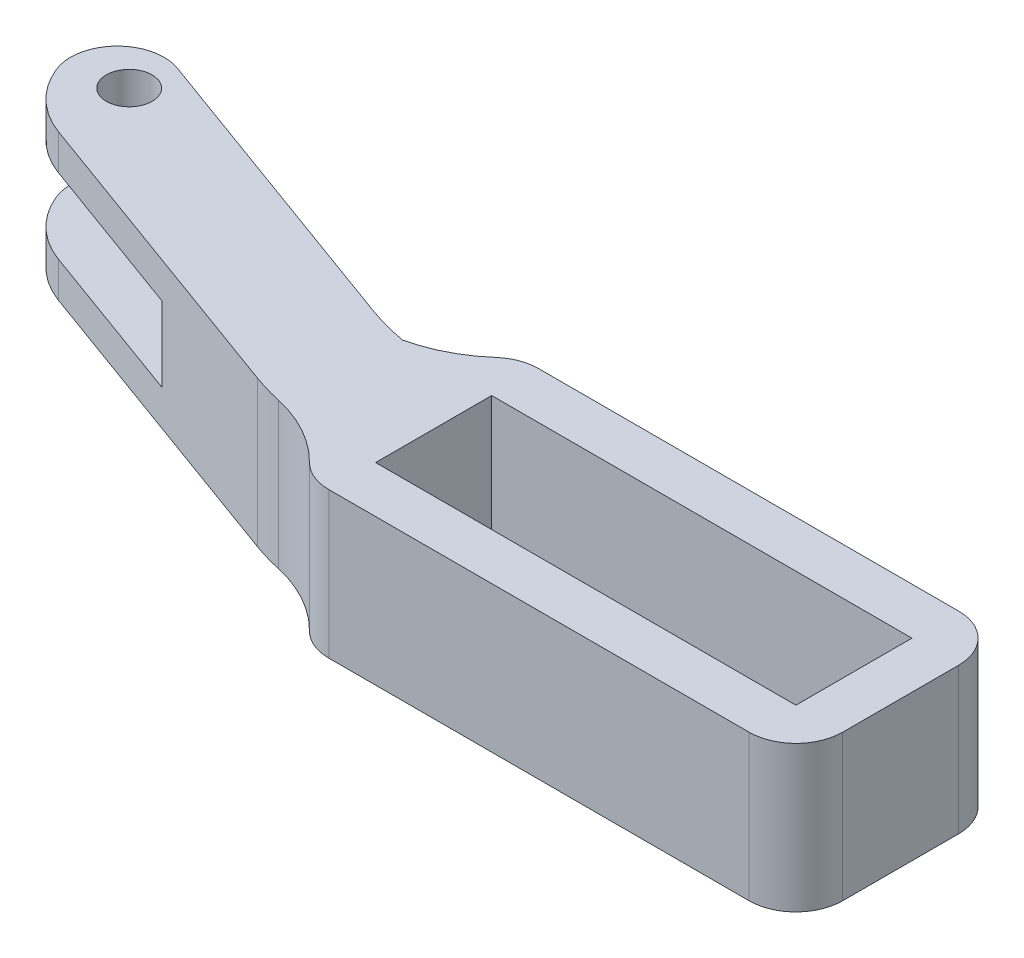
ISO-10303-21;
HEADER;
FILE_DESCRIPTION(('STEP AP214'),'2;1');
FILE_NAME('part.step','',(''),(''),'','','');
FILE_SCHEMA(('AUTOMOTIVE_DESIGN { 1 0 10303 214 1 1 1 1 }'));
ENDSEC;
DATA;
#1=APPLICATION_CONTEXT('core data for automotive mechanical design processes');
#2=APPLICATION_PROTOCOL_DEFINITION('international standard','automotive_design',2000,#1);
#3=PRODUCT_CONTEXT('',#1,'mechanical');
#4=PRODUCT('Part','Part','',(#3));
#5=PRODUCT_RELATED_PRODUCT_CATEGORY('part','',(#4));
#6=PRODUCT_DEFINITION_FORMATION('','',#4);
#7=PRODUCT_DEFINITION_CONTEXT('part definition',#1,'design');
#8=PRODUCT_DEFINITION('design','',#6,#7);
#9=PRODUCT_DEFINITION_SHAPE('','',#8);
#10=(LENGTH_UNIT() NAMED_UNIT(*) SI_UNIT(.MILLI.,.METRE.));
#11=(NAMED_UNIT(*) PLANE_ANGLE_UNIT() SI_UNIT($,.RADIAN.));
#12=(NAMED_UNIT(*) SI_UNIT($,.STERADIAN.) SOLID_ANGLE_UNIT());
#13=UNCERTAINTY_MEASURE_WITH_UNIT(LENGTH_MEASURE(1.E-05),#10,'distance_accuracy_value','');
#14=(GEOMETRIC_REPRESENTATION_CONTEXT(3) GLOBAL_UNCERTAINTY_ASSIGNED_CONTEXT((#13)) GLOBAL_UNIT_ASSIGNED_CONTEXT((#10,
#11,#12)) REPRESENTATION_CONTEXT('',''));
#15=CARTESIAN_POINT('',(0.,0.,0.));
#16=DIRECTION('',(0.,0.,1.));
#17=DIRECTION('',(1.,0.,0.));
#18=AXIS2_PLACEMENT_3D('',#15,#16,#17);
#19=CARTESIAN_POINT('',(-44.910929277711,8.8611956643176,7.59535906047761));
#20=DIRECTION('',(-0.342020143325668,0.,0.939692620785908));
#21=DIRECTION('',(0.939692620785909,0.,0.342020143325668));
#22=AXIS2_PLACEMENT_3D('',#19,#20,#21);
#23=PLANE('',#22);
#24=DIRECTION('',(-0.939692620785909,0.,-0.342020143325668));
#25=VECTOR('',#24,1.);
#26=CARTESIAN_POINT('',(-44.910929277711,5.0591956643176,7.59535906047761));
#27=LINE('',#26,#25);
#28=CARTESIAN_POINT('',(-46.3203878879577,5.05919566431759,7.08235807991763));
#29=VERTEX_POINT('',#28);
#30=CARTESIAN_POINT('',(-63.7047816934292,5.0591956643176,0.754956193964233));
#31=VERTEX_POINT('',#30);
#32=EDGE_CURVE('E10',#29,#31,#27,.T.);
#33=ORIENTED_EDGE('',*,*,#32,.F.);
#34=DIRECTION('',(0.,-1.,0.));
#35=VECTOR('',#34,1.);
#36=CARTESIAN_POINT('',(-46.3203878879577,1.05919566431748,7.08235807991763));
#37=LINE('',#36,#35);
#38=CARTESIAN_POINT('',(-46.3203878879577,-2.94080433568262,7.08235807991763));
#39=VERTEX_POINT('',#38);
#40=EDGE_CURVE('E24',#29,#39,#37,.T.);
#41=ORIENTED_EDGE('',*,*,#40,.T.);
#42=DIRECTION('',(-0.939692620785909,0.,-0.342020143325668));
#43=VECTOR('',#42,1.);
#44=CARTESIAN_POINT('',(-44.910929277711,-2.9408043356824,7.59535906047761));
#45=LINE('',#44,#43);
#46=CARTESIAN_POINT('',(-63.7047816934292,-2.9408043356824,0.754956193964233));
#47=VERTEX_POINT('',#46);
#48=EDGE_CURVE('E445',#39,#47,#45,.T.);
#49=ORIENTED_EDGE('',*,*,#48,.T.);
#50=DIRECTION('',(0.,-1.,0.));
#51=VECTOR('',#50,1.);
#52=CARTESIAN_POINT('',(-63.7047816934292,8.8611956643176,0.754956193964236));
#53=LINE('',#52,#51);
#54=CARTESIAN_POINT('',(-63.7047816934292,-6.7408043356824,0.754956193964236));
#55=VERTEX_POINT('',#54);
#56=EDGE_CURVE('E442',#47,#55,#53,.T.);
#57=ORIENTED_EDGE('',*,*,#56,.T.);
#58=DIRECTION('',(-0.939692620785909,0.,-0.342020143325668));
#59=VECTOR('',#58,1.);
#60=CARTESIAN_POINT('',(-44.910929277711,-6.7408043356824,7.59535906047761));
#61=LINE('',#60,#59);
#62=CARTESIAN_POINT('',(-30.259405927423,-6.7408043356824,12.9280774466387));
#63=VERTEX_POINT('',#62);
#64=EDGE_CURVE('E438',#63,#55,#61,.T.);
#65=ORIENTED_EDGE('',*,*,#64,.F.);
#66=DIRECTION('',(0.,1.,0.));
#67=VECTOR('',#66,1.);
#68=CARTESIAN_POINT('',(-30.259405927423,8.8591956643176,12.9280774466387));
#69=LINE('',#68,#67);
#70=CARTESIAN_POINT('',(-30.259405927423,8.8591956643176,12.9280774466387));
#71=VERTEX_POINT('',#70);
#72=EDGE_CURVE('E435',#63,#71,#69,.T.);
#73=ORIENTED_EDGE('',*,*,#72,.T.);
#74=DIRECTION('',(-0.939692620785909,0.,-0.342020143325668));
#75=VECTOR('',#74,1.);
#76=CARTESIAN_POINT('',(-44.910929277711,8.8591956643176,7.59535906047761));
#77=LINE('',#76,#75);
#78=CARTESIAN_POINT('',(-63.7047816934292,8.8591956643176,0.754956193964236));
#79=VERTEX_POINT('',#78);
#80=EDGE_CURVE('E432',#71,#79,#77,.T.);
#81=ORIENTED_EDGE('',*,*,#80,.T.);
#82=EDGE_CURVE('E431',#79,#31,#53,.T.);
#83=ORIENTED_EDGE('',*,*,#82,.T.);
#84=EDGE_LOOP('',(#33,#41,#49,#57,#65,#73,#81,#83));
#85=FACE_BOUND('',#84,.T.);
#86=ADVANCED_FACE('F16',(#85),#23,.T.);
#87=CARTESIAN_POINT('',(-47.8234247456533,-2.9428043356824,-0.645678424626456));
#88=DIRECTION('',(-0.0692737920599271,0.,-0.997597685308882));
#89=DIRECTION('',(-0.997597685308881,0.,0.0692737920599271));
#90=AXIS2_PLACEMENT_3D('',#87,#88,#89);
#91=PLANE('',#90);
#92=DIRECTION('',(0.997597685308881,0.,-0.0692737920599271));
#93=VECTOR('',#92,1.);
#94=CARTESIAN_POINT('',(-47.8234247456533,-2.9408043356824,-0.645678424626456));
#95=LINE('',#94,#93);
#96=CARTESIAN_POINT('',(-43.3957050477944,-2.94080433568262,-0.95314198249764));
#97=VERTEX_POINT('',#96);
#98=CARTESIAN_POINT('',(-35.7816767400393,-2.9408043356824,-1.48186475471068));
#99=VERTEX_POINT('',#98);
#100=EDGE_CURVE('E427',#97,#99,#95,.T.);
#101=ORIENTED_EDGE('',*,*,#100,.F.);
#102=DIRECTION('',(0.,1.,0.));
#103=VECTOR('',#102,1.);
#104=CARTESIAN_POINT('',(-43.3957050477944,-2.9428043356824,-0.95314198249764));
#105=LINE('',#104,#103);
#106=CARTESIAN_POINT('',(-43.3957050477944,5.0591956643176,-0.953141982497639));
#107=VERTEX_POINT('',#106);
#108=EDGE_CURVE('E424',#97,#107,#105,.T.);
#109=ORIENTED_EDGE('',*,*,#108,.T.);
#110=DIRECTION('',(-0.997597685308881,0.,0.0692737920599271));
#111=VECTOR('',#110,1.);
#112=CARTESIAN_POINT('',(-47.8234247456533,5.0591956643176,-0.645678424626455));
#113=LINE('',#112,#111);
#114=CARTESIAN_POINT('',(-35.7816767400393,5.0591956643176,-1.48186475471068));
#115=VERTEX_POINT('',#114);
#116=EDGE_CURVE('E420',#115,#107,#113,.T.);
#117=ORIENTED_EDGE('',*,*,#116,.F.);
#118=DIRECTION('',(0.,-1.,0.));
#119=VECTOR('',#118,1.);
#120=CARTESIAN_POINT('',(-35.7816767400393,8.8611956643176,-1.48186475471068));
#121=LINE('',#120,#119);
#122=EDGE_CURVE('E417',#115,#99,#121,.T.);
#123=ORIENTED_EDGE('',*,*,#122,.T.);
#124=EDGE_LOOP('',(#101,#109,#117,#123));
#125=FACE_BOUND('',#124,.T.);
#126=ADVANCED_FACE('F487',(#125),#91,.T.);
#127=CARTESIAN_POINT('',(-47.6167507916123,8.8611956643176,-5.78947942981958));
#128=DIRECTION('',(-0.342020143325668,0.,0.939692620785909));
#129=DIRECTION('',(0.939692620785909,0.,0.342020143325668));
#130=AXIS2_PLACEMENT_3D('',#127,#128,#129);
#131=PLANE('',#130);
#132=DIRECTION('',(0.939692620785909,0.,0.342020143325668));
#133=VECTOR('',#132,1.);
#134=CARTESIAN_POINT('',(-61.5988837549445,-2.9408043356824,-10.8785596400248));
#135=LINE('',#134,#133);
#136=CARTESIAN_POINT('',(-63.2093097010482,-2.9408043356824,-11.4647067488965));
#137=VERTEX_POINT('',#136);
#138=EDGE_CURVE('E413',#137,#99,#135,.T.);
#139=ORIENTED_EDGE('',*,*,#138,.T.);
#140=ORIENTED_EDGE('',*,*,#122,.F.);
#141=DIRECTION('',(0.939692620785909,0.,0.342020143325668));
#142=VECTOR('',#141,1.);
#143=CARTESIAN_POINT('',(-61.5988837549445,5.0591956643176,-10.8785596400248));
#144=LINE('',#143,#142);
#145=CARTESIAN_POINT('',(-63.2093097010482,5.0591956643176,-11.4647067488965));
#146=VERTEX_POINT('',#145);
#147=EDGE_CURVE('E410',#146,#115,#144,.T.);
#148=ORIENTED_EDGE('',*,*,#147,.F.);
#149=DIRECTION('',(0.,1.,0.));
#150=VECTOR('',#149,1.);
#151=CARTESIAN_POINT('',(-63.2093097010482,8.8591956643176,-11.4647067488965));
#152=LINE('',#151,#150);
#153=CARTESIAN_POINT('',(-63.2093097010482,8.8591956643176,-11.4647067488965));
#154=VERTEX_POINT('',#153);
#155=EDGE_CURVE('E204',#146,#154,#152,.T.);
#156=ORIENTED_EDGE('',*,*,#155,.T.);
#157=DIRECTION('',(-0.939692620785909,0.,-0.342020143325668));
#158=VECTOR('',#157,1.);
#159=CARTESIAN_POINT('',(-47.6167507916123,8.8591956643176,-5.78947942981958));
#160=LINE('',#159,#158);
#161=CARTESIAN_POINT('',(-30.259405927423,8.8591956643176,0.528077446638671));
#162=VERTEX_POINT('',#161);
#163=EDGE_CURVE('E404',#162,#154,#160,.T.);
#164=ORIENTED_EDGE('',*,*,#163,.F.);
#165=DIRECTION('',(0.,-1.,0.));
#166=VECTOR('',#165,1.);
#167=CARTESIAN_POINT('',(-30.259405927423,-6.7408043356824,0.528077446638676));
#168=LINE('',#167,#166);
#169=CARTESIAN_POINT('',(-30.259405927423,-6.7408043356824,0.528077446638671));
#170=VERTEX_POINT('',#169);
#171=EDGE_CURVE('E401',#162,#170,#168,.T.);
#172=ORIENTED_EDGE('',*,*,#171,.T.);
#173=DIRECTION('',(-0.939692620785909,0.,-0.342020143325668));
#174=VECTOR('',#173,1.);
#175=CARTESIAN_POINT('',(-47.6167507916123,-6.7408043356824,-5.78947942981958));
#176=LINE('',#175,#174);
#177=CARTESIAN_POINT('',(-63.2093097010482,-6.7408043356824,-11.4647067488965));
#178=VERTEX_POINT('',#177);
#179=EDGE_CURVE('E398',#170,#178,#176,.T.);
#180=ORIENTED_EDGE('',*,*,#179,.T.);
#181=DIRECTION('',(0.,1.,0.));
#182=VECTOR('',#181,1.);
#183=CARTESIAN_POINT('',(-63.2093097010482,-2.9408043356824,-11.4647067488965));
#184=LINE('',#183,#182);
#185=EDGE_CURVE('E395',#178,#137,#184,.T.);
#186=ORIENTED_EDGE('',*,*,#185,.T.);
#187=EDGE_LOOP('',(#139,#140,#148,#156,#164,#172,#180,#186));
#188=FACE_BOUND('',#187,.T.);
#189=ADVANCED_FACE('F490',(#188),#131,.F.);
#190=CARTESIAN_POINT('',(-60.2845802601725,8.8611956643176,-8.64197001389486));
#191=DIRECTION('',(0.,-1.,0.));
#192=DIRECTION('',(0.,0.,-1.));
#193=AXIS2_PLACEMENT_3D('',#190,#191,#192);
#194=CYLINDRICAL_SURFACE('',#193,10.);
#195=CARTESIAN_POINT('',(-60.2845802601725,-2.9408043356824,-8.64197001389486));
#196=DIRECTION('',(0.,1.,0.));
#197=DIRECTION('',(-1.,0.,0.));
#198=AXIS2_PLACEMENT_3D('',#195,#196,#197);
#199=CIRCLE('',#198,10.);
#200=CARTESIAN_POINT('',(-69.5542405751806,-2.9408043356824,-4.89051727603909));
#201=VERTEX_POINT('',#200);
#202=EDGE_CURVE('E392',#47,#201,#199,.F.);
#203=ORIENTED_EDGE('',*,*,#202,.T.);
#204=DIRECTION('',(0.,-1.,0.));
#205=VECTOR('',#204,1.);
#206=CARTESIAN_POINT('',(-69.5542405751806,8.8611956643176,-4.89051727603909));
#207=LINE('',#206,#205);
#208=CARTESIAN_POINT('',(-69.5542405751806,-6.7408043356824,-4.89051727603909));
#209=VERTEX_POINT('',#208);
#210=EDGE_CURVE('E389',#201,#209,#207,.T.);
#211=ORIENTED_EDGE('',*,*,#210,.T.);
#212=CARTESIAN_POINT('',(-60.2845802601725,-6.7408043356824,-8.64197001389486));
#213=DIRECTION('',(0.,-1.,0.));
#214=DIRECTION('',(0.,0.,-1.));
#215=AXIS2_PLACEMENT_3D('',#212,#213,#214);
#216=CIRCLE('',#215,10.);
#217=EDGE_CURVE('E385',#55,#209,#216,.T.);
#218=ORIENTED_EDGE('',*,*,#217,.F.);
#219=ORIENTED_EDGE('',*,*,#56,.F.);
#220=EDGE_LOOP('',(#203,#211,#218,#219));
#221=FACE_BOUND('',#220,.T.);
#222=ADVANCED_FACE('F475',(#221),#194,.T.);
#223=CARTESIAN_POINT('',(-4.96707686199287,-6.7408043356824,8.23576192699096));
#224=DIRECTION('',(0.,-1.,0.));
#225=DIRECTION('',(0.,0.,-1.));
#226=AXIS2_PLACEMENT_3D('',#223,#224,#225);
#227=PLANE('',#226);
#228=CARTESIAN_POINT('',(-63.9301591270672,-6.7408043356824,-7.04527770769894));
#229=DIRECTION('',(0.,-1.,0.));
#230=DIRECTION('',(0.,0.,-1.));
#231=AXIS2_PLACEMENT_3D('',#228,#229,#230);
#232=CIRCLE('',#231,2.45);
#233=CARTESIAN_POINT('',(-63.9301591270672,-6.7408043356824,-9.49527770769894));
#234=VERTEX_POINT('',#233);
#235=EDGE_CURVE('E381',#234,#234,#232,.T.);
#236=ORIENTED_EDGE('',*,*,#235,.F.);
#237=EDGE_LOOP('',(#236));
#238=FACE_BOUND('',#237,.T.);
#239=DIRECTION('',(1.,0.,0.));
#240=VECTOR('',#239,1.);
#241=CARTESIAN_POINT('',(6.3329231380071,-6.7408043356824,2.03576224579854));
#242=LINE('',#241,#240);
#243=CARTESIAN_POINT('',(-16.1170765431853,-6.7408043356824,2.03576224579854));
#244=VERTEX_POINT('',#243);
#245=CARTESIAN_POINT('',(28.7829228191995,-6.7408043356824,2.03576224579854));
#246=VERTEX_POINT('',#245);
#247=EDGE_CURVE('E377',#244,#246,#242,.T.);
#248=ORIENTED_EDGE('',*,*,#247,.F.);
#249=DIRECTION('',(0.,0.,1.));
#250=VECTOR('',#249,1.);
#251=CARTESIAN_POINT('',(-16.1170768619929,-6.7408043356824,13.935761926991));
#252=LINE('',#251,#250);
#253=CARTESIAN_POINT('',(-16.1170765431853,-6.7408043356824,14.4357616081834));
#254=VERTEX_POINT('',#253);
#255=EDGE_CURVE('E374',#244,#254,#252,.T.);
#256=ORIENTED_EDGE('',*,*,#255,.T.);
#257=DIRECTION('',(1.,0.,0.));
#258=VECTOR('',#257,1.);
#259=CARTESIAN_POINT('',(6.3329231380071,-6.7408043356824,14.4357616081834));
#260=LINE('',#259,#258);
#261=CARTESIAN_POINT('',(28.7829228191995,-6.7408043356824,14.4357616081834));
#262=VERTEX_POINT('',#261);
#263=EDGE_CURVE('E371',#254,#262,#260,.T.);
#264=ORIENTED_EDGE('',*,*,#263,.T.);
#265=DIRECTION('',(0.,0.,-1.));
#266=VECTOR('',#265,1.);
#267=CARTESIAN_POINT('',(28.7829228191995,-6.7408043356824,8.23576192699096));
#268=LINE('',#267,#266);
#269=EDGE_CURVE('E368',#262,#246,#268,.T.);
#270=ORIENTED_EDGE('',*,*,#269,.T.);
#271=EDGE_LOOP('',(#248,#256,#264,#270));
#272=FACE_BOUND('',#271,.T.);
#273=ORIENTED_EDGE('',*,*,#217,.T.);
#274=CARTESIAN_POINT('',(-64.9194104176766,-6.7408043356824,-6.76624364496697));
#275=DIRECTION('',(0.,-1.,0.));
#276=DIRECTION('',(0.,0.,-1.));
#277=AXIS2_PLACEMENT_3D('',#274,#275,#276);
#278=CIRCLE('',#277,5.);
#279=EDGE_CURVE('E364',#209,#178,#278,.T.);
#280=ORIENTED_EDGE('',*,*,#279,.T.);
#281=ORIENTED_EDGE('',*,*,#179,.F.);
#282=CARTESIAN_POINT('',(-21.7089023442813,-6.7408043356824,-22.9642380730091));
#283=DIRECTION('',(0.,-1.,0.));
#284=DIRECTION('',(0.,0.,-1.));
#285=AXIS2_PLACEMENT_3D('',#282,#283,#284);
#286=CIRCLE('',#285,25.);
#287=CARTESIAN_POINT('',(-26.0171067117498,-6.7408043356824,1.66175175741453));
#288=VERTEX_POINT('',#287);
#289=EDGE_CURVE('E361',#170,#288,#286,.F.);
#290=ORIENTED_EDGE('',*,*,#289,.T.);
#291=CARTESIAN_POINT('',(-29.3458334173159,-6.7408043356824,-12.964238073009));
#292=DIRECTION('',(0.,-1.,0.));
#293=DIRECTION('',(0.,0.,-1.));
#294=AXIS2_PLACEMENT_3D('',#291,#292,#293);
#295=CIRCLE('',#294,15.);
#296=CARTESIAN_POINT('',(-19.4242660008236,-6.7408043356824,-1.71423807300904));
#297=VERTEX_POINT('',#296);
#298=EDGE_CURVE('E358',#288,#297,#295,.F.);
#299=ORIENTED_EDGE('',*,*,#298,.T.);
#300=CARTESIAN_POINT('',(-16.1170768619929,-6.7408043356824,2.03576192699096));
#301=DIRECTION('',(0.,-1.,0.));
#302=DIRECTION('',(0.,0.,-1.));
#303=AXIS2_PLACEMENT_3D('',#300,#301,#302);
#304=CIRCLE('',#303,5.);
#305=CARTESIAN_POINT('',(-16.1170768619929,-6.7408043356824,-2.96423807300904));
#306=VERTEX_POINT('',#305);
#307=EDGE_CURVE('E355',#297,#306,#304,.T.);
#308=ORIENTED_EDGE('',*,*,#307,.T.);
#309=DIRECTION('',(1.,0.,0.));
#310=VECTOR('',#309,1.);
#311=CARTESIAN_POINT('',(6.3329231380071,-6.7408043356824,-2.96423807300904));
#312=LINE('',#311,#310);
#313=CARTESIAN_POINT('',(28.7829231380071,-6.7408043356824,-2.96423807300904));
#314=VERTEX_POINT('',#313);
#315=EDGE_CURVE('E352',#306,#314,#312,.T.);
#316=ORIENTED_EDGE('',*,*,#315,.T.);
#317=CARTESIAN_POINT('',(28.7829231380071,-6.7408043356824,2.03576192699096));
#318=DIRECTION('',(0.,-1.,0.));
#319=DIRECTION('',(0.,0.,-1.));
#320=AXIS2_PLACEMENT_3D('',#317,#318,#319);
#321=CIRCLE('',#320,5.);
#322=CARTESIAN_POINT('',(33.7829231380071,-6.7408043356824,2.03576192699096));
#323=VERTEX_POINT('',#322);
#324=EDGE_CURVE('E349',#314,#323,#321,.T.);
#325=ORIENTED_EDGE('',*,*,#324,.T.);
#326=DIRECTION('',(0.,0.,1.));
#327=VECTOR('',#326,1.);
#328=CARTESIAN_POINT('',(33.7829231380071,-6.7408043356824,16.9357619269909));
#329=LINE('',#328,#327);
#330=CARTESIAN_POINT('',(33.7829231380071,-6.7408043356824,14.435761926991));
#331=VERTEX_POINT('',#330);
#332=EDGE_CURVE('E346',#323,#331,#329,.T.);
#333=ORIENTED_EDGE('',*,*,#332,.T.);
#334=CARTESIAN_POINT('',(28.7829231380071,-6.7408043356824,14.435761926991));
#335=DIRECTION('',(0.,-1.,0.));
#336=DIRECTION('',(0.,0.,-1.));
#337=AXIS2_PLACEMENT_3D('',#334,#335,#336);
#338=CIRCLE('',#337,5.);
#339=CARTESIAN_POINT('',(28.7829231380071,-6.7408043356824,19.4357619269909));
#340=VERTEX_POINT('',#339);
#341=EDGE_CURVE('E343',#331,#340,#338,.T.);
#342=ORIENTED_EDGE('',*,*,#341,.T.);
#343=DIRECTION('',(1.,0.,0.));
#344=VECTOR('',#343,1.);
#345=CARTESIAN_POINT('',(6.3329231380071,-6.7408043356824,19.4357619269909));
#346=LINE('',#345,#344);
#347=CARTESIAN_POINT('',(-16.1170768619929,-6.7408043356824,19.4357619269909));
#348=VERTEX_POINT('',#347);
#349=EDGE_CURVE('E339',#348,#340,#346,.T.);
#350=ORIENTED_EDGE('',*,*,#349,.F.);
#351=CARTESIAN_POINT('',(-16.1170768619929,-6.7408043356824,14.435761926991));
#352=DIRECTION('',(0.,-1.,0.));
#353=DIRECTION('',(0.,0.,-1.));
#354=AXIS2_PLACEMENT_3D('',#351,#352,#353);
#355=CIRCLE('',#354,5.);
#356=CARTESIAN_POINT('',(-19.6738133294701,-6.7408043356824,17.9499653503741));
#357=VERTEX_POINT('',#356);
#358=EDGE_CURVE('E336',#348,#357,#355,.T.);
#359=ORIENTED_EDGE('',*,*,#358,.T.);
#360=CARTESIAN_POINT('',(-30.3440227319019,-6.7408043356824,28.4925756205234));
#361=DIRECTION('',(0.,-1.,0.));
#362=DIRECTION('',(0.,0.,-1.));
#363=AXIS2_PLACEMENT_3D('',#360,#361,#362);
#364=CIRCLE('',#363,15.);
#365=CARTESIAN_POINT('',(-27.1058525865441,-6.7408043356824,13.8462704854487));
#366=VERTEX_POINT('',#365);
#367=EDGE_CURVE('E333',#357,#366,#364,.F.);
#368=ORIENTED_EDGE('',*,*,#367,.T.);
#369=CARTESIAN_POINT('',(-21.7089023442813,-6.7408043356824,-10.564238073009));
#370=DIRECTION('',(0.,-1.,0.));
#371=DIRECTION('',(0.,0.,-1.));
#372=AXIS2_PLACEMENT_3D('',#369,#370,#371);
#373=CIRCLE('',#372,25.);
#374=EDGE_CURVE('E329',#366,#63,#373,.T.);
#375=ORIENTED_EDGE('',*,*,#374,.T.);
#376=ORIENTED_EDGE('',*,*,#64,.T.);
#377=EDGE_LOOP('',(#273,#280,#281,#290,#299,#308,#316,#325,#333,#342,#350,#359,#368,#375,#376));
#378=FACE_BOUND('',#377,.T.);
#379=ADVANCED_FACE('F478',(#238,#272,#378),#227,.T.);
#380=CARTESIAN_POINT('',(6.3329231380071,-6.7428043356824,19.4357619269909));
#381=DIRECTION('',(0.,0.,1.));
#382=DIRECTION('',(1.,0.,0.));
#383=AXIS2_PLACEMENT_3D('',#380,#381,#382);
#384=PLANE('',#383);
#385=ORIENTED_EDGE('',*,*,#349,.T.);
#386=DIRECTION('',(0.,1.,0.));
#387=VECTOR('',#386,1.);
#388=CARTESIAN_POINT('',(28.7829231380071,8.8591956643176,19.4357619269909));
#389=LINE('',#388,#387);
#390=CARTESIAN_POINT('',(28.7829231380071,8.8591956643176,19.4357619269909));
#391=VERTEX_POINT('',#390);
#392=EDGE_CURVE('E326',#340,#391,#389,.T.);
#393=ORIENTED_EDGE('',*,*,#392,.T.);
#394=DIRECTION('',(1.,0.,0.));
#395=VECTOR('',#394,1.);
#396=CARTESIAN_POINT('',(6.3329231380071,8.8591956643176,19.4357619269909));
#397=LINE('',#396,#395);
#398=CARTESIAN_POINT('',(-16.1170768619929,8.8591956643176,19.4357619269909));
#399=VERTEX_POINT('',#398);
#400=EDGE_CURVE('E322',#399,#391,#397,.T.);
#401=ORIENTED_EDGE('',*,*,#400,.F.);
#402=DIRECTION('',(0.,1.,0.));
#403=VECTOR('',#402,1.);
#404=CARTESIAN_POINT('',(-16.1170768619929,-6.7408043356824,19.4357619269909));
#405=LINE('',#404,#403);
#406=EDGE_CURVE('E318',#399,#348,#405,.F.);
#407=ORIENTED_EDGE('',*,*,#406,.T.);
#408=EDGE_LOOP('',(#385,#393,#401,#407));
#409=FACE_BOUND('',#408,.T.);
#410=ADVANCED_FACE('F530',(#409),#384,.T.);
#411=CARTESIAN_POINT('',(33.7829231380071,-6.7428043356824,16.9357619269909));
#412=DIRECTION('',(-1.,0.,0.));
#413=DIRECTION('',(0.,0.,1.));
#414=AXIS2_PLACEMENT_3D('',#411,#412,#413);
#415=PLANE('',#414);
#416=ORIENTED_EDGE('',*,*,#332,.F.);
#417=DIRECTION('',(0.,1.,0.));
#418=VECTOR('',#417,1.);
#419=CARTESIAN_POINT('',(33.7829231380071,-6.7428043356824,2.03576192699096));
#420=LINE('',#419,#418);
#421=CARTESIAN_POINT('',(33.7829231380071,8.8591956643176,2.03576192699096));
#422=VERTEX_POINT('',#421);
#423=EDGE_CURVE('E315',#323,#422,#420,.T.);
#424=ORIENTED_EDGE('',*,*,#423,.T.);
#425=DIRECTION('',(0.,0.,1.));
#426=VECTOR('',#425,1.);
#427=CARTESIAN_POINT('',(33.7829231380071,8.8591956643176,16.9357619269909));
#428=LINE('',#427,#426);
#429=CARTESIAN_POINT('',(33.7829231380071,8.8591956643176,14.435761926991));
#430=VERTEX_POINT('',#429);
#431=EDGE_CURVE('E312',#422,#430,#428,.T.);
#432=ORIENTED_EDGE('',*,*,#431,.T.);
#433=DIRECTION('',(0.,1.,0.));
#434=VECTOR('',#433,1.);
#435=CARTESIAN_POINT('',(33.7829231380071,-6.7408043356824,14.435761926991));
#436=LINE('',#435,#434);
#437=EDGE_CURVE('E308',#430,#331,#436,.F.);
#438=ORIENTED_EDGE('',*,*,#437,.T.);
#439=EDGE_LOOP('',(#416,#424,#432,#438));
#440=FACE_BOUND('',#439,.T.);
#441=ADVANCED_FACE('F522',(#440),#415,.F.);
#442=CARTESIAN_POINT('',(-16.1170768619929,-6.7428043356824,13.935761926991));
#443=DIRECTION('',(-1.,0.,0.));
#444=DIRECTION('',(0.,0.,1.));
#445=AXIS2_PLACEMENT_3D('',#442,#443,#444);
#446=PLANE('',#445);
#447=ORIENTED_EDGE('',*,*,#255,.F.);
#448=DIRECTION('',(0.,1.,0.));
#449=VECTOR('',#448,1.);
#450=CARTESIAN_POINT('',(-16.1170765431853,-6.7428043356824,2.03576224579854));
#451=LINE('',#450,#449);
#452=CARTESIAN_POINT('',(-16.1170765431853,8.8591956643176,2.03576224579854));
#453=VERTEX_POINT('',#452);
#454=EDGE_CURVE('E305',#244,#453,#451,.T.);
#455=ORIENTED_EDGE('',*,*,#454,.T.);
#456=DIRECTION('',(0.,0.,-1.));
#457=VECTOR('',#456,1.);
#458=CARTESIAN_POINT('',(-16.1170768619929,8.8591956643176,13.935761926991));
#459=LINE('',#458,#457);
#460=CARTESIAN_POINT('',(-16.1170765431853,8.8591956643176,14.4357616081834));
#461=VERTEX_POINT('',#460);
#462=EDGE_CURVE('E302',#453,#461,#459,.F.);
#463=ORIENTED_EDGE('',*,*,#462,.T.);
#464=DIRECTION('',(0.,1.,0.));
#465=VECTOR('',#464,1.);
#466=CARTESIAN_POINT('',(-16.1170765431853,-6.7428043356824,14.4357616081834));
#467=LINE('',#466,#465);
#468=EDGE_CURVE('E298',#254,#461,#467,.T.);
#469=ORIENTED_EDGE('',*,*,#468,.F.);
#470=EDGE_LOOP('',(#447,#455,#463,#469));
#471=FACE_BOUND('',#470,.T.);
#472=ADVANCED_FACE('F569',(#471),#446,.F.);
#473=CARTESIAN_POINT('',(6.3329231380071,-6.7428043356824,2.03576224579854));
#474=DIRECTION('',(0.,0.,1.));
#475=DIRECTION('',(1.,0.,0.));
#476=AXIS2_PLACEMENT_3D('',#473,#474,#475);
#477=PLANE('',#476);
#478=ORIENTED_EDGE('',*,*,#454,.F.);
#479=ORIENTED_EDGE('',*,*,#247,.T.);
#480=DIRECTION('',(0.,1.,0.));
#481=VECTOR('',#480,1.);
#482=CARTESIAN_POINT('',(28.7829228191995,-6.7428043356824,2.03576224579854));
#483=LINE('',#482,#481);
#484=CARTESIAN_POINT('',(28.7829228191995,8.8591956643176,2.03576224579854));
#485=VERTEX_POINT('',#484);
#486=EDGE_CURVE('E295',#246,#485,#483,.T.);
#487=ORIENTED_EDGE('',*,*,#486,.T.);
#488=DIRECTION('',(1.,0.,0.));
#489=VECTOR('',#488,1.);
#490=CARTESIAN_POINT('',(6.3329231380071,8.8591956643176,2.03576224579854));
#491=LINE('',#490,#489);
#492=EDGE_CURVE('E291',#453,#485,#491,.T.);
#493=ORIENTED_EDGE('',*,*,#492,.F.);
#494=EDGE_LOOP('',(#478,#479,#487,#493));
#495=FACE_BOUND('',#494,.T.);
#496=ADVANCED_FACE('F572',(#495),#477,.T.);
#497=CARTESIAN_POINT('',(28.7829228191995,-6.7428043356824,8.23576192699096));
#498=DIRECTION('',(1.,0.,0.));
#499=DIRECTION('',(0.,0.,-1.));
#500=AXIS2_PLACEMENT_3D('',#497,#498,#499);
#501=PLANE('',#500);
#502=ORIENTED_EDGE('',*,*,#269,.F.);
#503=DIRECTION('',(0.,1.,0.));
#504=VECTOR('',#503,1.);
#505=CARTESIAN_POINT('',(28.7829228191995,-6.7428043356824,14.4357616081834));
#506=LINE('',#505,#504);
#507=CARTESIAN_POINT('',(28.7829228191995,8.8591956643176,14.4357616081834));
#508=VERTEX_POINT('',#507);
#509=EDGE_CURVE('E288',#262,#508,#506,.T.);
#510=ORIENTED_EDGE('',*,*,#509,.T.);
#511=DIRECTION('',(0.,0.,-1.));
#512=VECTOR('',#511,1.);
#513=CARTESIAN_POINT('',(28.7829228191995,8.8591956643176,8.23576192699096));
#514=LINE('',#513,#512);
#515=EDGE_CURVE('E284',#508,#485,#514,.T.);
#516=ORIENTED_EDGE('',*,*,#515,.T.);
#517=ORIENTED_EDGE('',*,*,#486,.F.);
#518=EDGE_LOOP('',(#502,#510,#516,#517));
#519=FACE_BOUND('',#518,.T.);
#520=ADVANCED_FACE('F576',(#519),#501,.F.);
#521=CARTESIAN_POINT('',(6.3329231380071,-6.7428043356824,14.4357616081834));
#522=DIRECTION('',(0.,0.,1.));
#523=DIRECTION('',(1.,0.,0.));
#524=AXIS2_PLACEMENT_3D('',#521,#522,#523);
#525=PLANE('',#524);
#526=ORIENTED_EDGE('',*,*,#263,.F.);
#527=ORIENTED_EDGE('',*,*,#468,.T.);
#528=DIRECTION('',(1.,0.,0.));
#529=VECTOR('',#528,1.);
#530=CARTESIAN_POINT('',(6.3329231380071,8.8591956643176,14.4357616081834));
#531=LINE('',#530,#529);
#532=EDGE_CURVE('E280',#461,#508,#531,.T.);
#533=ORIENTED_EDGE('',*,*,#532,.T.);
#534=ORIENTED_EDGE('',*,*,#509,.F.);
#535=EDGE_LOOP('',(#526,#527,#533,#534));
#536=FACE_BOUND('',#535,.T.);
#537=ADVANCED_FACE('F580',(#536),#525,.F.);
#538=CARTESIAN_POINT('',(6.3329231380071,-6.7428043356824,-2.96423807300904));
#539=DIRECTION('',(0.,0.,1.));
#540=DIRECTION('',(1.,0.,0.));
#541=AXIS2_PLACEMENT_3D('',#538,#539,#540);
#542=PLANE('',#541);
#543=DIRECTION('',(1.,0.,0.));
#544=VECTOR('',#543,1.);
#545=CARTESIAN_POINT('',(6.3329231380071,8.8591956643176,-2.96423807300904));
#546=LINE('',#545,#544);
#547=CARTESIAN_POINT('',(-16.1170768619929,8.8591956643176,-2.96423807300904));
#548=VERTEX_POINT('',#547);
#549=CARTESIAN_POINT('',(28.7829231380071,8.8591956643176,-2.96423807300904));
#550=VERTEX_POINT('',#549);
#551=EDGE_CURVE('E277',#548,#550,#546,.T.);
#552=ORIENTED_EDGE('',*,*,#551,.T.);
#553=DIRECTION('',(0.,1.,0.));
#554=VECTOR('',#553,1.);
#555=CARTESIAN_POINT('',(28.7829231380071,-6.7428043356824,-2.96423807300904));
#556=LINE('',#555,#554);
#557=EDGE_CURVE('E273',#550,#314,#556,.F.);
#558=ORIENTED_EDGE('',*,*,#557,.T.);
#559=ORIENTED_EDGE('',*,*,#315,.F.);
#560=DIRECTION('',(0.,1.,0.));
#561=VECTOR('',#560,1.);
#562=CARTESIAN_POINT('',(-16.1170768619929,-6.7428043356824,-2.96423807300904));
#563=LINE('',#562,#561);
#564=EDGE_CURVE('E270',#306,#548,#563,.T.);
#565=ORIENTED_EDGE('',*,*,#564,.T.);
#566=EDGE_LOOP('',(#552,#558,#559,#565));
#567=FACE_BOUND('',#566,.T.);
#568=ADVANCED_FACE('F510',(#567),#542,.F.);
#569=CARTESIAN_POINT('',(6.33292313800711,8.8591956643176,8.23576192699096));
#570=DIRECTION('',(0.,1.,0.));
#571=DIRECTION('',(-1.,0.,0.));
#572=AXIS2_PLACEMENT_3D('',#569,#570,#571);
#573=PLANE('',#572);
#574=CARTESIAN_POINT('',(-63.9301591270672,8.8591956643176,-7.04527770769894));
#575=DIRECTION('',(0.,1.,0.));
#576=DIRECTION('',(0.,0.,1.));
#577=AXIS2_PLACEMENT_3D('',#574,#575,#576);
#578=CIRCLE('',#577,2.45);
#579=CARTESIAN_POINT('',(-63.9301591270672,8.8591956643176,-4.59527770769894));
#580=VERTEX_POINT('',#579);
#581=EDGE_CURVE('E266',#580,#580,#578,.T.);
#582=ORIENTED_EDGE('',*,*,#581,.F.);
#583=EDGE_LOOP('',(#582));
#584=FACE_BOUND('',#583,.T.);
#585=ORIENTED_EDGE('',*,*,#462,.F.);
#586=ORIENTED_EDGE('',*,*,#492,.T.);
#587=ORIENTED_EDGE('',*,*,#515,.F.);
#588=ORIENTED_EDGE('',*,*,#532,.F.);
#589=EDGE_LOOP('',(#585,#586,#587,#588));
#590=FACE_BOUND('',#589,.T.);
#591=ORIENTED_EDGE('',*,*,#163,.T.);
#592=CARTESIAN_POINT('',(-64.9194104176766,8.8591956643176,-6.76624364496697));
#593=DIRECTION('',(0.,1.,0.));
#594=DIRECTION('',(0.,0.,1.));
#595=AXIS2_PLACEMENT_3D('',#592,#593,#594);
#596=CIRCLE('',#595,5.);
#597=CARTESIAN_POINT('',(-69.5542405751806,8.8591956643176,-4.89051727603909));
#598=VERTEX_POINT('',#597);
#599=EDGE_CURVE('E263',#154,#598,#596,.T.);
#600=ORIENTED_EDGE('',*,*,#599,.T.);
#601=CARTESIAN_POINT('',(-60.2845802601725,8.8591956643176,-8.64197001389486));
#602=DIRECTION('',(0.,1.,0.));
#603=DIRECTION('',(0.,0.,1.));
#604=AXIS2_PLACEMENT_3D('',#601,#602,#603);
#605=CIRCLE('',#604,10.);
#606=EDGE_CURVE('E186',#79,#598,#605,.F.);
#607=ORIENTED_EDGE('',*,*,#606,.F.);
#608=ORIENTED_EDGE('',*,*,#80,.F.);
#609=CARTESIAN_POINT('',(-21.7089023442813,8.8591956643176,-10.564238073009));
#610=DIRECTION('',(0.,1.,0.));
#611=DIRECTION('',(0.,0.,1.));
#612=AXIS2_PLACEMENT_3D('',#609,#610,#611);
#613=CIRCLE('',#612,25.);
#614=CARTESIAN_POINT('',(-27.1058525865441,8.8591956643176,13.8462704854487));
#615=VERTEX_POINT('',#614);
#616=EDGE_CURVE('E259',#71,#615,#613,.T.);
#617=ORIENTED_EDGE('',*,*,#616,.T.);
#618=CARTESIAN_POINT('',(-30.3440227319019,8.8591956643176,28.4925756205234));
#619=DIRECTION('',(0.,1.,0.));
#620=DIRECTION('',(0.,0.,1.));
#621=AXIS2_PLACEMENT_3D('',#618,#619,#620);
#622=CIRCLE('',#621,15.);
#623=CARTESIAN_POINT('',(-19.6738133294701,8.8591956643176,17.9499653503741));
#624=VERTEX_POINT('',#623);
#625=EDGE_CURVE('E256',#615,#624,#622,.F.);
#626=ORIENTED_EDGE('',*,*,#625,.T.);
#627=CARTESIAN_POINT('',(-16.1170768619929,8.8591956643176,14.435761926991));
#628=DIRECTION('',(0.,1.,0.));
#629=DIRECTION('',(0.,0.,1.));
#630=AXIS2_PLACEMENT_3D('',#627,#628,#629);
#631=CIRCLE('',#630,5.);
#632=EDGE_CURVE('E252',#624,#399,#631,.T.);
#633=ORIENTED_EDGE('',*,*,#632,.T.);
#634=ORIENTED_EDGE('',*,*,#400,.T.);
#635=CARTESIAN_POINT('',(28.7829231380071,8.8591956643176,14.435761926991));
#636=DIRECTION('',(0.,1.,0.));
#637=DIRECTION('',(0.,0.,1.));
#638=AXIS2_PLACEMENT_3D('',#635,#636,#637);
#639=CIRCLE('',#638,5.);
#640=EDGE_CURVE('E248',#391,#430,#639,.T.);
#641=ORIENTED_EDGE('',*,*,#640,.T.);
#642=ORIENTED_EDGE('',*,*,#431,.F.);
#643=CARTESIAN_POINT('',(28.7829231380071,8.8591956643176,2.03576192699096));
#644=DIRECTION('',(0.,1.,0.));
#645=DIRECTION('',(0.,0.,1.));
#646=AXIS2_PLACEMENT_3D('',#643,#644,#645);
#647=CIRCLE('',#646,5.);
#648=EDGE_CURVE('E244',#422,#550,#647,.T.);
#649=ORIENTED_EDGE('',*,*,#648,.T.);
#650=ORIENTED_EDGE('',*,*,#551,.F.);
#651=CARTESIAN_POINT('',(-16.1170768619929,8.8591956643176,2.03576192699096));
#652=DIRECTION('',(0.,1.,0.));
#653=DIRECTION('',(0.,0.,1.));
#654=AXIS2_PLACEMENT_3D('',#651,#652,#653);
#655=CIRCLE('',#654,5.);
#656=CARTESIAN_POINT('',(-19.4242660008236,8.8591956643176,-1.71423807300904));
#657=VERTEX_POINT('',#656);
#658=EDGE_CURVE('E241',#548,#657,#655,.T.);
#659=ORIENTED_EDGE('',*,*,#658,.T.);
#660=CARTESIAN_POINT('',(-29.3458334173159,8.8591956643176,-12.964238073009));
#661=DIRECTION('',(0.,1.,0.));
#662=DIRECTION('',(0.,0.,1.));
#663=AXIS2_PLACEMENT_3D('',#660,#661,#662);
#664=CIRCLE('',#663,15.);
#665=CARTESIAN_POINT('',(-26.0171067117498,8.8591956643176,1.66175175741453));
#666=VERTEX_POINT('',#665);
#667=EDGE_CURVE('E238',#657,#666,#664,.F.);
#668=ORIENTED_EDGE('',*,*,#667,.T.);
#669=CARTESIAN_POINT('',(-21.7089023442813,8.8591956643176,-22.9642380730091));
#670=DIRECTION('',(0.,1.,0.));
#671=DIRECTION('',(0.,0.,1.));
#672=AXIS2_PLACEMENT_3D('',#669,#670,#671);
#673=CIRCLE('',#672,25.);
#674=EDGE_CURVE('E234',#666,#162,#673,.F.);
#675=ORIENTED_EDGE('',*,*,#674,.T.);
#676=EDGE_LOOP('',(#591,#600,#607,#608,#617,#626,#633,#634,#641,#642,#649,#650,#659,#668,#675));
#677=FACE_BOUND('',#676,.T.);
#678=ADVANCED_FACE('F512',(#584,#590,#677),#573,.T.);
#679=CARTESIAN_POINT('',(28.7829231380071,-6.7428043356824,2.03576192699096));
#680=DIRECTION('',(0.,1.,0.));
#681=DIRECTION('',(0.,0.,1.));
#682=AXIS2_PLACEMENT_3D('',#679,#680,#681);
#683=CYLINDRICAL_SURFACE('',#682,5.);
#684=ORIENTED_EDGE('',*,*,#324,.F.);
#685=ORIENTED_EDGE('',*,*,#557,.F.);
#686=ORIENTED_EDGE('',*,*,#648,.F.);
#687=ORIENTED_EDGE('',*,*,#423,.F.);
#688=EDGE_LOOP('',(#684,#685,#686,#687));
#689=FACE_BOUND('',#688,.T.);
#690=ADVANCED_FACE('F519',(#689),#683,.T.);
#691=CARTESIAN_POINT('',(28.7829231380071,-6.7428043356824,14.435761926991));
#692=DIRECTION('',(0.,-1.,0.));
#693=DIRECTION('',(0.,0.,-1.));
#694=AXIS2_PLACEMENT_3D('',#691,#692,#693);
#695=CYLINDRICAL_SURFACE('',#694,5.);
#696=ORIENTED_EDGE('',*,*,#341,.F.);
#697=ORIENTED_EDGE('',*,*,#437,.F.);
#698=ORIENTED_EDGE('',*,*,#640,.F.);
#699=ORIENTED_EDGE('',*,*,#392,.F.);
#700=EDGE_LOOP('',(#696,#697,#698,#699));
#701=FACE_BOUND('',#700,.T.);
#702=ADVANCED_FACE('F528',(#701),#695,.T.);
#703=CARTESIAN_POINT('',(-16.1170768619929,-6.7428043356824,2.03576192699096));
#704=DIRECTION('',(0.,1.,0.));
#705=DIRECTION('',(0.,0.,1.));
#706=AXIS2_PLACEMENT_3D('',#703,#704,#705);
#707=CYLINDRICAL_SURFACE('',#706,5.);
#708=ORIENTED_EDGE('',*,*,#307,.F.);
#709=DIRECTION('',(0.,1.,0.));
#710=VECTOR('',#709,1.);
#711=CARTESIAN_POINT('',(-19.4242660008236,-6.7428043356824,-1.71423807300905));
#712=LINE('',#711,#710);
#713=EDGE_CURVE('E230',#297,#657,#712,.T.);
#714=ORIENTED_EDGE('',*,*,#713,.T.);
#715=ORIENTED_EDGE('',*,*,#658,.F.);
#716=ORIENTED_EDGE('',*,*,#564,.F.);
#717=EDGE_LOOP('',(#708,#714,#715,#716));
#718=FACE_BOUND('',#717,.T.);
#719=ADVANCED_FACE('F506',(#718),#707,.T.);
#720=CARTESIAN_POINT('',(-16.1170768619929,-6.7428043356824,14.435761926991));
#721=DIRECTION('',(0.,-1.,0.));
#722=DIRECTION('',(0.,0.,-1.));
#723=AXIS2_PLACEMENT_3D('',#720,#721,#722);
#724=CYLINDRICAL_SURFACE('',#723,5.);
#725=ORIENTED_EDGE('',*,*,#632,.F.);
#726=DIRECTION('',(0.,-1.,0.));
#727=VECTOR('',#726,1.);
#728=CARTESIAN_POINT('',(-19.6738133294701,-6.7428043356824,17.9499653503741));
#729=LINE('',#728,#727);
#730=EDGE_CURVE('E191',#624,#357,#729,.T.);
#731=ORIENTED_EDGE('',*,*,#730,.T.);
#732=ORIENTED_EDGE('',*,*,#358,.F.);
#733=ORIENTED_EDGE('',*,*,#406,.F.);
#734=EDGE_LOOP('',(#725,#731,#732,#733));
#735=FACE_BOUND('',#734,.T.);
#736=ADVANCED_FACE('F535',(#735),#724,.T.);
#737=ORIENTED_EDGE('',*,*,#606,.T.);
#738=DIRECTION('',(0.,-1.,0.));
#739=VECTOR('',#738,1.);
#740=CARTESIAN_POINT('',(-69.5542405751806,8.8611956643176,-4.89051727603909));
#741=LINE('',#740,#739);
#742=CARTESIAN_POINT('',(-69.5542405751806,5.0591956643176,-4.89051727603909));
#743=VERTEX_POINT('',#742);
#744=EDGE_CURVE('E180',#598,#743,#741,.T.);
#745=ORIENTED_EDGE('',*,*,#744,.T.);
#746=CARTESIAN_POINT('',(-60.2845802601725,5.0591956643176,-8.64197001389486));
#747=DIRECTION('',(0.,1.,0.));
#748=DIRECTION('',(-1.,0.,0.));
#749=AXIS2_PLACEMENT_3D('',#746,#747,#748);
#750=CIRCLE('',#749,10.);
#751=EDGE_CURVE('E184',#31,#743,#750,.F.);
#752=ORIENTED_EDGE('',*,*,#751,.F.);
#753=ORIENTED_EDGE('',*,*,#82,.F.);
#754=EDGE_LOOP('',(#737,#745,#752,#753));
#755=FACE_BOUND('',#754,.T.);
#756=ADVANCED_FACE('F182',(#755),#194,.T.);
#757=CARTESIAN_POINT('',(-21.7089023442813,8.8611956643176,-22.9642380730091));
#758=DIRECTION('',(0.,1.,0.));
#759=DIRECTION('',(0.,0.,1.));
#760=AXIS2_PLACEMENT_3D('',#757,#758,#759);
#761=CYLINDRICAL_SURFACE('',#760,25.);
#762=ORIENTED_EDGE('',*,*,#674,.F.);
#763=DIRECTION('',(0.,1.,0.));
#764=VECTOR('',#763,1.);
#765=CARTESIAN_POINT('',(-26.01710671175,1.0591956643176,1.6617517574145));
#766=LINE('',#765,#764);
#767=EDGE_CURVE('E201',#666,#288,#766,.F.);
#768=ORIENTED_EDGE('',*,*,#767,.T.);
#769=ORIENTED_EDGE('',*,*,#289,.F.);
#770=ORIENTED_EDGE('',*,*,#171,.F.);
#771=EDGE_LOOP('',(#762,#768,#769,#770));
#772=FACE_BOUND('',#771,.T.);
#773=ADVANCED_FACE('F495',(#772),#761,.F.);
#774=CARTESIAN_POINT('',(-21.7089023442813,8.8611956643176,-10.564238073009));
#775=DIRECTION('',(0.,-1.,0.));
#776=DIRECTION('',(0.,0.,-1.));
#777=AXIS2_PLACEMENT_3D('',#774,#775,#776);
#778=CYLINDRICAL_SURFACE('',#777,25.);
#779=ORIENTED_EDGE('',*,*,#374,.F.);
#780=DIRECTION('',(0.,-1.,0.));
#781=VECTOR('',#780,1.);
#782=CARTESIAN_POINT('',(-27.1058525865441,8.8611956643176,13.8462704854487));
#783=LINE('',#782,#781);
#784=EDGE_CURVE('E213',#366,#615,#783,.F.);
#785=ORIENTED_EDGE('',*,*,#784,.T.);
#786=ORIENTED_EDGE('',*,*,#616,.F.);
#787=ORIENTED_EDGE('',*,*,#72,.F.);
#788=EDGE_LOOP('',(#779,#785,#786,#787));
#789=FACE_BOUND('',#788,.T.);
#790=ADVANCED_FACE('F541',(#789),#778,.T.);
#791=CARTESIAN_POINT('',(-29.3458334173159,-6.7428043356824,-12.964238073009));
#792=DIRECTION('',(0.,1.,0.));
#793=DIRECTION('',(0.,0.,1.));
#794=AXIS2_PLACEMENT_3D('',#791,#792,#793);
#795=CYLINDRICAL_SURFACE('',#794,15.);
#796=ORIENTED_EDGE('',*,*,#667,.F.);
#797=ORIENTED_EDGE('',*,*,#713,.F.);
#798=ORIENTED_EDGE('',*,*,#298,.F.);
#799=ORIENTED_EDGE('',*,*,#767,.F.);
#800=EDGE_LOOP('',(#796,#797,#798,#799));
#801=FACE_BOUND('',#800,.T.);
#802=ADVANCED_FACE('F501',(#801),#795,.F.);
#803=CARTESIAN_POINT('',(-30.3440227319019,-6.7428043356824,28.4925756205234));
#804=DIRECTION('',(0.,-1.,0.));
#805=DIRECTION('',(0.,0.,-1.));
#806=AXIS2_PLACEMENT_3D('',#803,#804,#805);
#807=CYLINDRICAL_SURFACE('',#806,15.);
#808=ORIENTED_EDGE('',*,*,#367,.F.);
#809=ORIENTED_EDGE('',*,*,#730,.F.);
#810=ORIENTED_EDGE('',*,*,#625,.F.);
#811=ORIENTED_EDGE('',*,*,#784,.F.);
#812=EDGE_LOOP('',(#808,#809,#810,#811));
#813=FACE_BOUND('',#812,.T.);
#814=ADVANCED_FACE('F544',(#813),#807,.F.);
#815=CARTESIAN_POINT('',(-70.1493873380862,5.0591956643176,12.6137558796229));
#816=DIRECTION('',(0.,1.,0.));
#817=DIRECTION('',(-1.,0.,0.));
#818=AXIS2_PLACEMENT_3D('',#815,#816,#817);
#819=PLANE('',#818);
#820=ORIENTED_EDGE('',*,*,#147,.T.);
#821=ORIENTED_EDGE('',*,*,#116,.T.);
#822=DIRECTION('',(-0.342020143325668,0.,0.939692620785909));
#823=VECTOR('',#822,1.);
#824=CARTESIAN_POINT('',(-37.769884304816,5.05919566431759,-16.4099574397301));
#825=LINE('',#824,#823);
#826=EDGE_CURVE('E206',#107,#29,#825,.T.);
#827=ORIENTED_EDGE('',*,*,#826,.T.);
#828=ORIENTED_EDGE('',*,*,#32,.T.);
#829=ORIENTED_EDGE('',*,*,#751,.T.);
#830=CARTESIAN_POINT('',(-64.9194104176766,5.0591956643176,-6.76624364496697));
#831=DIRECTION('',(0.,1.,0.));
#832=DIRECTION('',(-1.,0.,0.));
#833=AXIS2_PLACEMENT_3D('',#830,#831,#832);
#834=CIRCLE('',#833,5.);
#835=EDGE_CURVE('E198',#743,#146,#834,.F.);
#836=ORIENTED_EDGE('',*,*,#835,.T.);
#837=EDGE_LOOP('',(#820,#821,#827,#828,#829,#836));
#838=FACE_BOUND('',#837,.T.);
#839=CARTESIAN_POINT('',(-63.9301591270672,5.0591956643176,-7.04527770769894));
#840=DIRECTION('',(0.,1.,0.));
#841=DIRECTION('',(-1.,0.,0.));
#842=AXIS2_PLACEMENT_3D('',#839,#840,#841);
#843=CIRCLE('',#842,2.45);
#844=CARTESIAN_POINT('',(-66.3801591270672,5.0591956643176,-7.04527770769894));
#845=VERTEX_POINT('',#844);
#846=EDGE_CURVE('E207',#845,#845,#843,.T.);
#847=ORIENTED_EDGE('',*,*,#846,.T.);
#848=EDGE_LOOP('',(#847));
#849=FACE_BOUND('',#848,.T.);
#850=ADVANCED_FACE('F196',(#838,#849),#819,.F.);
#851=CARTESIAN_POINT('',(-70.1493873380862,-2.9408043356824,12.6137558796229));
#852=DIRECTION('',(0.,1.,0.));
#853=DIRECTION('',(-1.,0.,0.));
#854=AXIS2_PLACEMENT_3D('',#851,#852,#853);
#855=PLANE('',#854);
#856=DIRECTION('',(-0.342020143325668,0.,0.939692620785909));
#857=VECTOR('',#856,1.);
#858=CARTESIAN_POINT('',(-37.769884304816,-2.94080433568262,-16.4099574397301));
#859=LINE('',#858,#857);
#860=EDGE_CURVE('E217',#97,#39,#859,.T.);
#861=ORIENTED_EDGE('',*,*,#860,.F.);
#862=ORIENTED_EDGE('',*,*,#100,.T.);
#863=ORIENTED_EDGE('',*,*,#138,.F.);
#864=CARTESIAN_POINT('',(-64.9194104176766,-2.9408043356824,-6.76624364496697));
#865=DIRECTION('',(0.,1.,0.));
#866=DIRECTION('',(-1.,0.,0.));
#867=AXIS2_PLACEMENT_3D('',#864,#865,#866);
#868=CIRCLE('',#867,5.);
#869=EDGE_CURVE('E452',#137,#201,#868,.T.);
#870=ORIENTED_EDGE('',*,*,#869,.T.);
#871=ORIENTED_EDGE('',*,*,#202,.F.);
#872=ORIENTED_EDGE('',*,*,#48,.F.);
#873=EDGE_LOOP('',(#861,#862,#863,#870,#871,#872));
#874=FACE_BOUND('',#873,.T.);
#875=CARTESIAN_POINT('',(-63.9301591270672,-2.9408043356824,-7.04527770769894));
#876=DIRECTION('',(0.,1.,0.));
#877=DIRECTION('',(-1.,0.,0.));
#878=AXIS2_PLACEMENT_3D('',#875,#876,#877);
#879=CIRCLE('',#878,2.45);
#880=CARTESIAN_POINT('',(-66.3801591270672,-2.94080433568239,-7.04527770769894));
#881=VERTEX_POINT('',#880);
#882=EDGE_CURVE('E450',#881,#881,#879,.T.);
#883=ORIENTED_EDGE('',*,*,#882,.F.);
#884=EDGE_LOOP('',(#883));
#885=FACE_BOUND('',#884,.T.);
#886=ADVANCED_FACE('F467',(#874,#885),#855,.T.);
#887=CARTESIAN_POINT('',(-63.9301591270672,18.2591956643176,-7.04527770769894));
#888=DIRECTION('',(0.,-1.,0.));
#889=DIRECTION('',(0.,0.,-1.));
#890=AXIS2_PLACEMENT_3D('',#887,#888,#889);
#891=CYLINDRICAL_SURFACE('',#890,2.45);
#892=ORIENTED_EDGE('',*,*,#882,.T.);
#893=EDGE_LOOP('',(#892));
#894=FACE_BOUND('',#893,.T.);
#895=ORIENTED_EDGE('',*,*,#235,.T.);
#896=EDGE_LOOP('',(#895));
#897=FACE_BOUND('',#896,.T.);
#898=ADVANCED_FACE('F633',(#894,#897),#891,.F.);
#899=ORIENTED_EDGE('',*,*,#581,.T.);
#900=EDGE_LOOP('',(#899));
#901=FACE_BOUND('',#900,.T.);
#902=ORIENTED_EDGE('',*,*,#846,.F.);
#903=EDGE_LOOP('',(#902));
#904=FACE_BOUND('',#903,.T.);
#905=ADVANCED_FACE('F642',(#901,#904),#891,.F.);
#906=CARTESIAN_POINT('',(-64.9194104176766,8.8611956643176,-6.76624364496697));
#907=DIRECTION('',(0.,-1.,0.));
#908=DIRECTION('',(0.,0.,-1.));
#909=AXIS2_PLACEMENT_3D('',#906,#907,#908);
#910=CYLINDRICAL_SURFACE('',#909,5.);
#911=ORIENTED_EDGE('',*,*,#599,.F.);
#912=ORIENTED_EDGE('',*,*,#155,.F.);
#913=ORIENTED_EDGE('',*,*,#835,.F.);
#914=ORIENTED_EDGE('',*,*,#744,.F.);
#915=EDGE_LOOP('',(#911,#912,#913,#914));
#916=FACE_BOUND('',#915,.T.);
#917=ADVANCED_FACE('F203',(#916),#910,.T.);
#918=CARTESIAN_POINT('',(-64.9194104176766,8.8611956643176,-6.76624364496697));
#919=DIRECTION('',(0.,-1.,0.));
#920=DIRECTION('',(0.,0.,-1.));
#921=AXIS2_PLACEMENT_3D('',#918,#919,#920);
#922=CYLINDRICAL_SURFACE('',#921,5.);
#923=ORIENTED_EDGE('',*,*,#869,.F.);
#924=ORIENTED_EDGE('',*,*,#185,.F.);
#925=ORIENTED_EDGE('',*,*,#279,.F.);
#926=ORIENTED_EDGE('',*,*,#210,.F.);
#927=EDGE_LOOP('',(#923,#924,#925,#926));
#928=FACE_BOUND('',#927,.T.);
#929=ADVANCED_FACE('F472',(#928),#922,.T.);
#930=CARTESIAN_POINT('',(-37.769884304816,1.05919566431748,-16.4099574397301));
#931=DIRECTION('',(-0.939692620785909,0.,-0.342020143325668));
#932=DIRECTION('',(-0.342020143325668,0.,0.939692620785909));
#933=AXIS2_PLACEMENT_3D('',#930,#931,#932);
#934=PLANE('',#933);
#935=ORIENTED_EDGE('',*,*,#860,.T.);
#936=ORIENTED_EDGE('',*,*,#40,.F.);
#937=ORIENTED_EDGE('',*,*,#826,.F.);
#938=ORIENTED_EDGE('',*,*,#108,.F.);
#939=EDGE_LOOP('',(#935,#936,#937,#938));
#940=FACE_BOUND('',#939,.T.);
#941=ADVANCED_FACE('F485',(#940),#934,.T.);
#942=CLOSED_SHELL('',(#86,#126,#189,#222,#379,#410,#441,#472,#496,#520,#537,#568,#678,#690,#702,
#719,#736,#756,#773,#790,#802,#814,#850,#886,#898,#905,#917,#929,#941));
#943=MANIFOLD_SOLID_BREP('B1',#942);
#944=ADVANCED_BREP_SHAPE_REPRESENTATION('',(#18,#943),#14);
#945=SHAPE_DEFINITION_REPRESENTATION(#9,#944);
ENDSEC;
END-ISO-10303-21;
